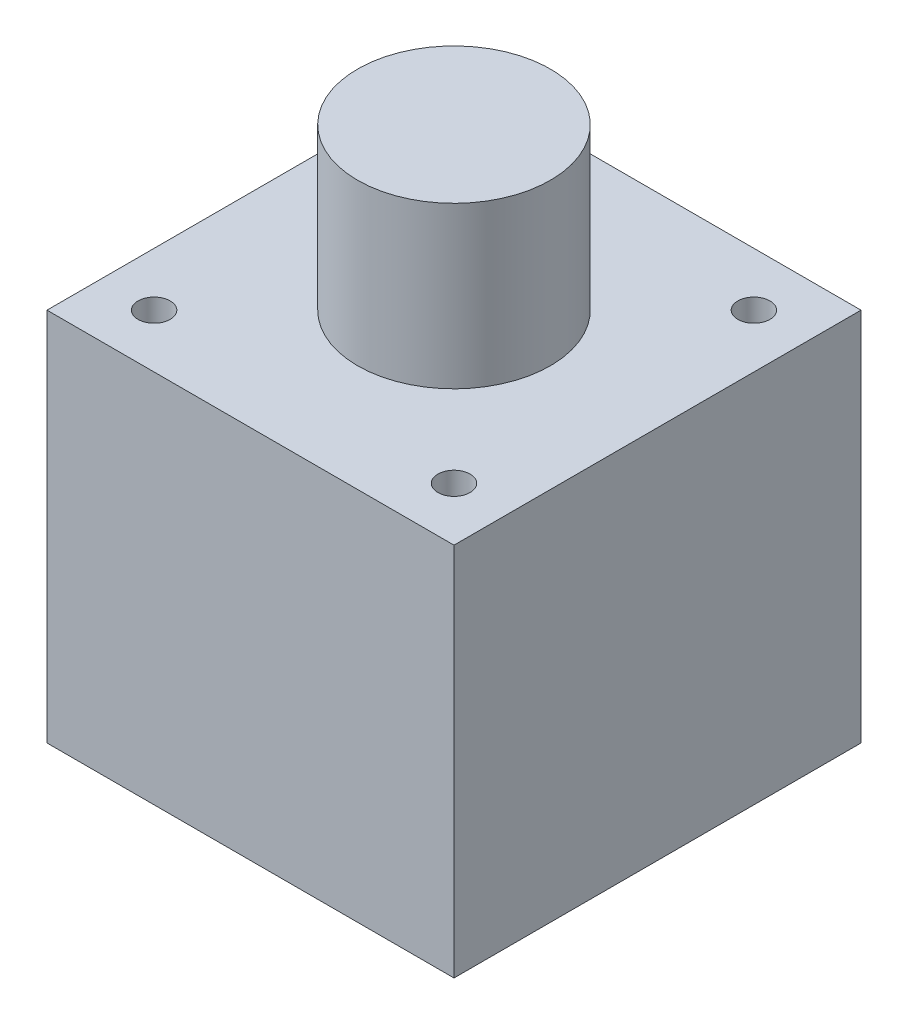
ISO-10303-21;
HEADER;
FILE_DESCRIPTION(('STEP AP214'),'2;1');
FILE_NAME('part.step','',(''),(''),'','','');
FILE_SCHEMA(('AUTOMOTIVE_DESIGN { 1 0 10303 214 1 1 1 1 }'));
ENDSEC;
DATA;
#1=APPLICATION_CONTEXT('core data for automotive mechanical design processes');
#2=APPLICATION_PROTOCOL_DEFINITION('international standard','automotive_design',2000,#1);
#3=PRODUCT_CONTEXT('',#1,'mechanical');
#4=PRODUCT('Part','Part','',(#3));
#5=PRODUCT_RELATED_PRODUCT_CATEGORY('part','',(#4));
#6=PRODUCT_DEFINITION_FORMATION('','',#4);
#7=PRODUCT_DEFINITION_CONTEXT('part definition',#1,'design');
#8=PRODUCT_DEFINITION('design','',#6,#7);
#9=PRODUCT_DEFINITION_SHAPE('','',#8);
#10=(LENGTH_UNIT() NAMED_UNIT(*) SI_UNIT(.MILLI.,.METRE.));
#11=(NAMED_UNIT(*) PLANE_ANGLE_UNIT() SI_UNIT($,.RADIAN.));
#12=(NAMED_UNIT(*) SI_UNIT($,.STERADIAN.) SOLID_ANGLE_UNIT());
#13=UNCERTAINTY_MEASURE_WITH_UNIT(LENGTH_MEASURE(1.E-05),#10,'distance_accuracy_value','');
#14=(GEOMETRIC_REPRESENTATION_CONTEXT(3) GLOBAL_UNCERTAINTY_ASSIGNED_CONTEXT((#13)) GLOBAL_UNIT_ASSIGNED_CONTEXT((#10,
#11,#12)) REPRESENTATION_CONTEXT('',''));
#15=CARTESIAN_POINT('',(0.,0.,0.));
#16=DIRECTION('',(0.,0.,1.));
#17=DIRECTION('',(1.,0.,0.));
#18=AXIS2_PLACEMENT_3D('',#15,#16,#17);
#19=CARTESIAN_POINT('',(19.,35.,19.));
#20=DIRECTION('',(-1.,0.,0.));
#21=DIRECTION('',(0.,0.,1.));
#22=AXIS2_PLACEMENT_3D('',#19,#20,#21);
#23=PLANE('',#22);
#24=DIRECTION('',(0.,0.,-1.));
#25=VECTOR('',#24,1.);
#26=CARTESIAN_POINT('',(19.,0.,19.));
#27=LINE('',#26,#25);
#28=CARTESIAN_POINT('',(19.,0.,19.));
#29=VERTEX_POINT('',#28);
#30=CARTESIAN_POINT('',(19.,0.,-19.));
#31=VERTEX_POINT('',#30);
#32=EDGE_CURVE('E100',#29,#31,#27,.T.);
#33=ORIENTED_EDGE('',*,*,#32,.T.);
#34=DIRECTION('',(0.,-1.,0.));
#35=VECTOR('',#34,1.);
#36=CARTESIAN_POINT('',(19.,35.,-19.));
#37=LINE('',#36,#35);
#38=CARTESIAN_POINT('',(19.,35.,-19.));
#39=VERTEX_POINT('',#38);
#40=EDGE_CURVE('E11',#39,#31,#37,.T.);
#41=ORIENTED_EDGE('',*,*,#40,.F.);
#42=DIRECTION('',(0.,0.,-1.));
#43=VECTOR('',#42,1.);
#44=CARTESIAN_POINT('',(19.,35.,19.));
#45=LINE('',#44,#43);
#46=CARTESIAN_POINT('',(19.,35.,19.));
#47=VERTEX_POINT('',#46);
#48=EDGE_CURVE('E85',#47,#39,#45,.T.);
#49=ORIENTED_EDGE('',*,*,#48,.F.);
#50=DIRECTION('',(0.,-1.,0.));
#51=VECTOR('',#50,1.);
#52=CARTESIAN_POINT('',(19.,35.,19.));
#53=LINE('',#52,#51);
#54=EDGE_CURVE('E52',#47,#29,#53,.T.);
#55=ORIENTED_EDGE('',*,*,#54,.T.);
#56=EDGE_LOOP('',(#33,#41,#49,#55));
#57=FACE_BOUND('',#56,.T.);
#58=ADVANCED_FACE('F35',(#57),#23,.F.);
#59=CARTESIAN_POINT('',(19.,35.,-19.));
#60=DIRECTION('',(0.,0.,1.));
#61=DIRECTION('',(1.,0.,0.));
#62=AXIS2_PLACEMENT_3D('',#59,#60,#61);
#63=PLANE('',#62);
#64=DIRECTION('',(-1.,0.,0.));
#65=VECTOR('',#64,1.);
#66=CARTESIAN_POINT('',(19.,0.,-19.));
#67=LINE('',#66,#65);
#68=CARTESIAN_POINT('',(-19.,0.,-19.));
#69=VERTEX_POINT('',#68);
#70=EDGE_CURVE('E90',#31,#69,#67,.T.);
#71=ORIENTED_EDGE('',*,*,#70,.T.);
#72=DIRECTION('',(0.,-1.,0.));
#73=VECTOR('',#72,1.);
#74=CARTESIAN_POINT('',(-19.,35.,-19.));
#75=LINE('',#74,#73);
#76=CARTESIAN_POINT('',(-19.,35.,-19.));
#77=VERTEX_POINT('',#76);
#78=EDGE_CURVE('E44',#77,#69,#75,.T.);
#79=ORIENTED_EDGE('',*,*,#78,.F.);
#80=DIRECTION('',(-1.,0.,0.));
#81=VECTOR('',#80,1.);
#82=CARTESIAN_POINT('',(19.,35.,-19.));
#83=LINE('',#82,#81);
#84=EDGE_CURVE('E77',#39,#77,#83,.T.);
#85=ORIENTED_EDGE('',*,*,#84,.F.);
#86=ORIENTED_EDGE('',*,*,#40,.T.);
#87=EDGE_LOOP('',(#71,#79,#85,#86));
#88=FACE_BOUND('',#87,.T.);
#89=ADVANCED_FACE('F89',(#88),#63,.F.);
#90=CARTESIAN_POINT('',(-19.,35.,19.));
#91=DIRECTION('',(-1.,0.,0.));
#92=DIRECTION('',(0.,0.,1.));
#93=AXIS2_PLACEMENT_3D('',#90,#91,#92);
#94=PLANE('',#93);
#95=DIRECTION('',(0.,0.,-1.));
#96=VECTOR('',#95,1.);
#97=CARTESIAN_POINT('',(-19.,0.,19.));
#98=LINE('',#97,#96);
#99=CARTESIAN_POINT('',(-19.,0.,19.));
#100=VERTEX_POINT('',#99);
#101=EDGE_CURVE('E104',#100,#69,#98,.T.);
#102=ORIENTED_EDGE('',*,*,#101,.F.);
#103=DIRECTION('',(0.,-1.,0.));
#104=VECTOR('',#103,1.);
#105=CARTESIAN_POINT('',(-19.,35.,19.));
#106=LINE('',#105,#104);
#107=CARTESIAN_POINT('',(-19.,35.,19.));
#108=VERTEX_POINT('',#107);
#109=EDGE_CURVE('E66',#108,#100,#106,.T.);
#110=ORIENTED_EDGE('',*,*,#109,.F.);
#111=DIRECTION('',(0.,0.,-1.));
#112=VECTOR('',#111,1.);
#113=CARTESIAN_POINT('',(-19.,35.,19.));
#114=LINE('',#113,#112);
#115=EDGE_CURVE('E84',#108,#77,#114,.T.);
#116=ORIENTED_EDGE('',*,*,#115,.T.);
#117=ORIENTED_EDGE('',*,*,#78,.T.);
#118=EDGE_LOOP('',(#102,#110,#116,#117));
#119=FACE_BOUND('',#118,.T.);
#120=ADVANCED_FACE('F94',(#119),#94,.T.);
#121=CARTESIAN_POINT('',(19.,35.,19.));
#122=DIRECTION('',(0.,0.,1.));
#123=DIRECTION('',(1.,0.,0.));
#124=AXIS2_PLACEMENT_3D('',#121,#122,#123);
#125=PLANE('',#124);
#126=DIRECTION('',(-1.,0.,0.));
#127=VECTOR('',#126,1.);
#128=CARTESIAN_POINT('',(19.,0.,19.));
#129=LINE('',#128,#127);
#130=EDGE_CURVE('E106',#29,#100,#129,.T.);
#131=ORIENTED_EDGE('',*,*,#130,.F.);
#132=ORIENTED_EDGE('',*,*,#54,.F.);
#133=DIRECTION('',(-1.,0.,0.));
#134=VECTOR('',#133,1.);
#135=CARTESIAN_POINT('',(19.,35.,19.));
#136=LINE('',#135,#134);
#137=EDGE_CURVE('E95',#47,#108,#136,.T.);
#138=ORIENTED_EDGE('',*,*,#137,.T.);
#139=ORIENTED_EDGE('',*,*,#109,.T.);
#140=EDGE_LOOP('',(#131,#132,#138,#139));
#141=FACE_BOUND('',#140,.T.);
#142=ADVANCED_FACE('F151',(#141),#125,.T.);
#143=CARTESIAN_POINT('',(0.,35.,0.));
#144=DIRECTION('',(0.,1.,0.));
#145=DIRECTION('',(0.,0.,1.));
#146=AXIS2_PLACEMENT_3D('',#143,#144,#145);
#147=PLANE('',#146);
#148=CARTESIAN_POINT('',(14.,35.,14.));
#149=DIRECTION('',(0.,1.,0.));
#150=DIRECTION('',(0.,0.,1.));
#151=AXIS2_PLACEMENT_3D('',#148,#149,#150);
#152=CIRCLE('',#151,1.49999999999999);
#153=CARTESIAN_POINT('',(14.,35.,15.5));
#154=VERTEX_POINT('',#153);
#155=EDGE_CURVE('E132',#154,#154,#152,.T.);
#156=ORIENTED_EDGE('',*,*,#155,.F.);
#157=EDGE_LOOP('',(#156));
#158=FACE_BOUND('',#157,.T.);
#159=CARTESIAN_POINT('',(14.,35.,-14.));
#160=DIRECTION('',(0.,1.,0.));
#161=DIRECTION('',(0.,0.,1.));
#162=AXIS2_PLACEMENT_3D('',#159,#160,#161);
#163=CIRCLE('',#162,1.49999999999999);
#164=CARTESIAN_POINT('',(14.,35.,-12.5));
#165=VERTEX_POINT('',#164);
#166=EDGE_CURVE('E126',#165,#165,#163,.T.);
#167=ORIENTED_EDGE('',*,*,#166,.F.);
#168=EDGE_LOOP('',(#167));
#169=FACE_BOUND('',#168,.T.);
#170=CARTESIAN_POINT('',(-14.,35.,-14.));
#171=DIRECTION('',(0.,1.,0.));
#172=DIRECTION('',(0.,0.,1.));
#173=AXIS2_PLACEMENT_3D('',#170,#171,#172);
#174=CIRCLE('',#173,1.49999999999999);
#175=CARTESIAN_POINT('',(-14.,35.,-12.5));
#176=VERTEX_POINT('',#175);
#177=EDGE_CURVE('E120',#176,#176,#174,.T.);
#178=ORIENTED_EDGE('',*,*,#177,.F.);
#179=EDGE_LOOP('',(#178));
#180=FACE_BOUND('',#179,.T.);
#181=CARTESIAN_POINT('',(-14.,35.,14.));
#182=DIRECTION('',(0.,1.,0.));
#183=DIRECTION('',(0.,0.,1.));
#184=AXIS2_PLACEMENT_3D('',#181,#182,#183);
#185=CIRCLE('',#184,1.49999999999999);
#186=CARTESIAN_POINT('',(-14.,35.,15.5));
#187=VERTEX_POINT('',#186);
#188=EDGE_CURVE('E38',#187,#187,#185,.T.);
#189=ORIENTED_EDGE('',*,*,#188,.F.);
#190=EDGE_LOOP('',(#189));
#191=FACE_BOUND('',#190,.T.);
#192=CARTESIAN_POINT('',(0.,35.,0.));
#193=DIRECTION('',(0.,1.,0.));
#194=DIRECTION('',(0.,0.,1.));
#195=AXIS2_PLACEMENT_3D('',#192,#193,#194);
#196=CIRCLE('',#195,9.);
#197=CARTESIAN_POINT('',(0.,35.,9.));
#198=VERTEX_POINT('',#197);
#199=EDGE_CURVE('E112',#198,#198,#196,.T.);
#200=ORIENTED_EDGE('',*,*,#199,.F.);
#201=EDGE_LOOP('',(#200));
#202=FACE_BOUND('',#201,.T.);
#203=ORIENTED_EDGE('',*,*,#48,.T.);
#204=ORIENTED_EDGE('',*,*,#84,.T.);
#205=ORIENTED_EDGE('',*,*,#115,.F.);
#206=ORIENTED_EDGE('',*,*,#137,.F.);
#207=EDGE_LOOP('',(#203,#204,#205,#206));
#208=FACE_BOUND('',#207,.T.);
#209=ADVANCED_FACE('F81',(#158,#169,#180,#191,#202,#208),#147,.T.);
#210=CARTESIAN_POINT('',(0.,0.,0.));
#211=DIRECTION('',(0.,1.,0.));
#212=DIRECTION('',(0.,0.,1.));
#213=AXIS2_PLACEMENT_3D('',#210,#211,#212);
#214=PLANE('',#213);
#215=CARTESIAN_POINT('',(14.,0.,14.));
#216=DIRECTION('',(0.,-1.,0.));
#217=DIRECTION('',(0.,0.,-1.));
#218=AXIS2_PLACEMENT_3D('',#215,#216,#217);
#219=CIRCLE('',#218,1.49999999999999);
#220=CARTESIAN_POINT('',(14.,0.,12.5));
#221=VERTEX_POINT('',#220);
#222=EDGE_CURVE('E135',#221,#221,#219,.T.);
#223=ORIENTED_EDGE('',*,*,#222,.F.);
#224=EDGE_LOOP('',(#223));
#225=FACE_BOUND('',#224,.T.);
#226=CARTESIAN_POINT('',(14.,0.,-14.));
#227=DIRECTION('',(0.,-1.,0.));
#228=DIRECTION('',(0.,0.,-1.));
#229=AXIS2_PLACEMENT_3D('',#226,#227,#228);
#230=CIRCLE('',#229,1.5);
#231=CARTESIAN_POINT('',(14.,0.,-15.5));
#232=VERTEX_POINT('',#231);
#233=EDGE_CURVE('E129',#232,#232,#230,.T.);
#234=ORIENTED_EDGE('',*,*,#233,.F.);
#235=EDGE_LOOP('',(#234));
#236=FACE_BOUND('',#235,.T.);
#237=CARTESIAN_POINT('',(-14.,0.,-14.));
#238=DIRECTION('',(0.,-1.,0.));
#239=DIRECTION('',(0.,0.,-1.));
#240=AXIS2_PLACEMENT_3D('',#237,#238,#239);
#241=CIRCLE('',#240,1.5);
#242=CARTESIAN_POINT('',(-14.,0.,-15.5));
#243=VERTEX_POINT('',#242);
#244=EDGE_CURVE('E123',#243,#243,#241,.T.);
#245=ORIENTED_EDGE('',*,*,#244,.F.);
#246=EDGE_LOOP('',(#245));
#247=FACE_BOUND('',#246,.T.);
#248=CARTESIAN_POINT('',(-14.,0.,14.));
#249=DIRECTION('',(0.,-1.,0.));
#250=DIRECTION('',(0.,0.,-1.));
#251=AXIS2_PLACEMENT_3D('',#248,#249,#250);
#252=CIRCLE('',#251,1.49999999999999);
#253=CARTESIAN_POINT('',(-14.,0.,12.5));
#254=VERTEX_POINT('',#253);
#255=EDGE_CURVE('E117',#254,#254,#252,.T.);
#256=ORIENTED_EDGE('',*,*,#255,.F.);
#257=EDGE_LOOP('',(#256));
#258=FACE_BOUND('',#257,.T.);
#259=ORIENTED_EDGE('',*,*,#32,.F.);
#260=ORIENTED_EDGE('',*,*,#130,.T.);
#261=ORIENTED_EDGE('',*,*,#101,.T.);
#262=ORIENTED_EDGE('',*,*,#70,.F.);
#263=EDGE_LOOP('',(#259,#260,#261,#262));
#264=FACE_BOUND('',#263,.T.);
#265=ADVANCED_FACE('F141',(#225,#236,#247,#258,#264),#214,.F.);
#266=CARTESIAN_POINT('',(0.,50.,0.));
#267=DIRECTION('',(0.,-1.,0.));
#268=DIRECTION('',(0.,0.,-1.));
#269=AXIS2_PLACEMENT_3D('',#266,#267,#268);
#270=CYLINDRICAL_SURFACE('',#269,9.);
#271=CARTESIAN_POINT('',(0.,50.,0.));
#272=DIRECTION('',(0.,1.,0.));
#273=DIRECTION('',(0.,0.,1.));
#274=AXIS2_PLACEMENT_3D('',#271,#272,#273);
#275=CIRCLE('',#274,9.);
#276=CARTESIAN_POINT('',(0.,50.,9.));
#277=VERTEX_POINT('',#276);
#278=EDGE_CURVE('E102',#277,#277,#275,.T.);
#279=ORIENTED_EDGE('',*,*,#278,.F.);
#280=EDGE_LOOP('',(#279));
#281=FACE_BOUND('',#280,.T.);
#282=ORIENTED_EDGE('',*,*,#199,.T.);
#283=EDGE_LOOP('',(#282));
#284=FACE_BOUND('',#283,.T.);
#285=ADVANCED_FACE('F144',(#281,#284),#270,.T.);
#286=CARTESIAN_POINT('',(0.,50.,0.));
#287=DIRECTION('',(0.,1.,0.));
#288=DIRECTION('',(0.,0.,1.));
#289=AXIS2_PLACEMENT_3D('',#286,#287,#288);
#290=PLANE('',#289);
#291=ORIENTED_EDGE('',*,*,#278,.T.);
#292=EDGE_LOOP('',(#291));
#293=FACE_BOUND('',#292,.T.);
#294=ADVANCED_FACE('F185',(#293),#290,.T.);
#295=CARTESIAN_POINT('',(-14.,0.,14.));
#296=DIRECTION('',(0.,-1.,0.));
#297=DIRECTION('',(0.,0.,-1.));
#298=AXIS2_PLACEMENT_3D('',#295,#296,#297);
#299=CYLINDRICAL_SURFACE('',#298,1.49999999999999);
#300=ORIENTED_EDGE('',*,*,#188,.T.);
#301=EDGE_LOOP('',(#300));
#302=FACE_BOUND('',#301,.T.);
#303=ORIENTED_EDGE('',*,*,#255,.T.);
#304=EDGE_LOOP('',(#303));
#305=FACE_BOUND('',#304,.T.);
#306=ADVANCED_FACE('F196',(#302,#305),#299,.F.);
#307=CARTESIAN_POINT('',(-14.,0.,-14.));
#308=DIRECTION('',(0.,-1.,0.));
#309=DIRECTION('',(0.,0.,-1.));
#310=AXIS2_PLACEMENT_3D('',#307,#308,#309);
#311=CYLINDRICAL_SURFACE('',#310,1.49999999999999);
#312=ORIENTED_EDGE('',*,*,#177,.T.);
#313=EDGE_LOOP('',(#312));
#314=FACE_BOUND('',#313,.T.);
#315=ORIENTED_EDGE('',*,*,#244,.T.);
#316=EDGE_LOOP('',(#315));
#317=FACE_BOUND('',#316,.T.);
#318=ADVANCED_FACE('F216',(#314,#317),#311,.F.);
#319=CARTESIAN_POINT('',(14.,0.,-14.));
#320=DIRECTION('',(0.,-1.,0.));
#321=DIRECTION('',(0.,0.,-1.));
#322=AXIS2_PLACEMENT_3D('',#319,#320,#321);
#323=CYLINDRICAL_SURFACE('',#322,1.49999999999999);
#324=ORIENTED_EDGE('',*,*,#166,.T.);
#325=EDGE_LOOP('',(#324));
#326=FACE_BOUND('',#325,.T.);
#327=ORIENTED_EDGE('',*,*,#233,.T.);
#328=EDGE_LOOP('',(#327));
#329=FACE_BOUND('',#328,.T.);
#330=ADVANCED_FACE('F226',(#326,#329),#323,.F.);
#331=CARTESIAN_POINT('',(14.,0.,14.));
#332=DIRECTION('',(0.,-1.,0.));
#333=DIRECTION('',(0.,0.,-1.));
#334=AXIS2_PLACEMENT_3D('',#331,#332,#333);
#335=CYLINDRICAL_SURFACE('',#334,1.49999999999999);
#336=ORIENTED_EDGE('',*,*,#155,.T.);
#337=EDGE_LOOP('',(#336));
#338=FACE_BOUND('',#337,.T.);
#339=ORIENTED_EDGE('',*,*,#222,.T.);
#340=EDGE_LOOP('',(#339));
#341=FACE_BOUND('',#340,.T.);
#342=ADVANCED_FACE('F139',(#338,#341),#335,.F.);
#343=CLOSED_SHELL('',(#58,#89,#120,#142,#209,#265,#285,#294,#306,#318,#330,#342));
#344=MANIFOLD_SOLID_BREP('B2',#343);
#345=ADVANCED_BREP_SHAPE_REPRESENTATION('',(#18,#344),#14);
#346=SHAPE_DEFINITION_REPRESENTATION(#9,#345);
ENDSEC;
END-ISO-10303-21;
